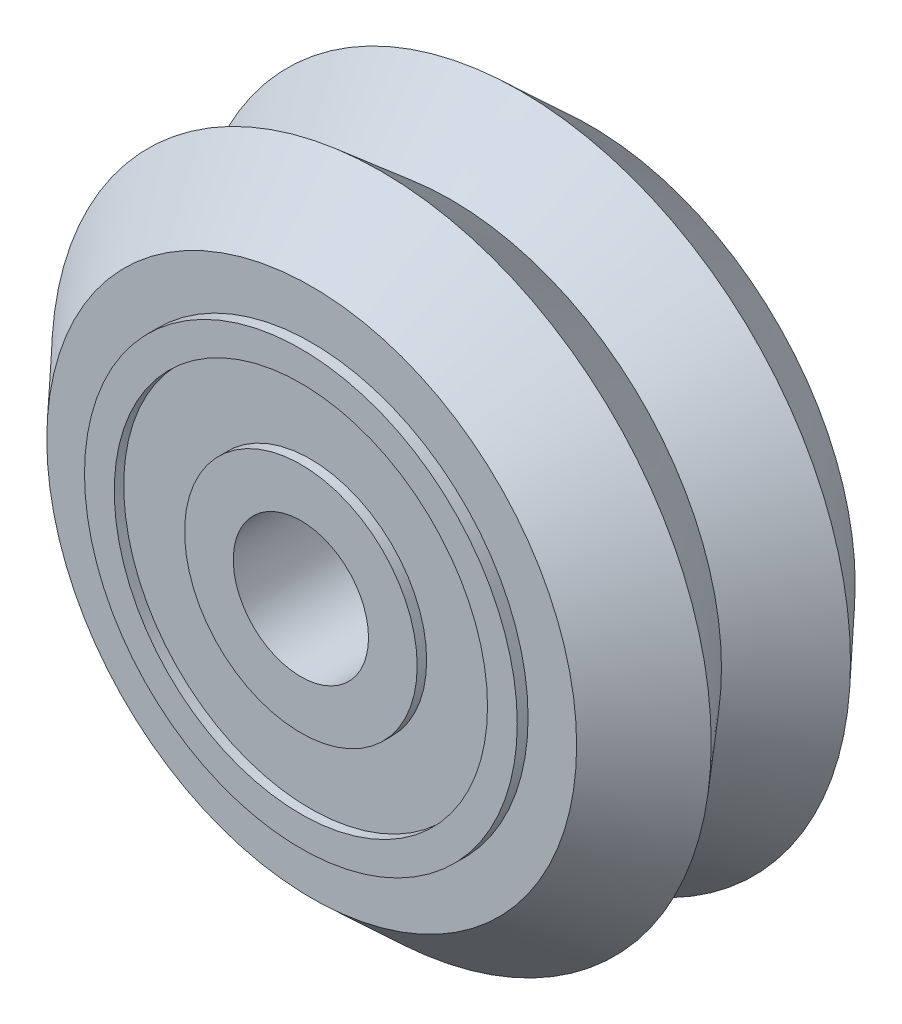
ISO-10303-21;
HEADER;
FILE_DESCRIPTION(('STEP AP214'),'2;1');
FILE_NAME('part.step','',(''),(''),'','','');
FILE_SCHEMA(('AUTOMOTIVE_DESIGN { 1 0 10303 214 1 1 1 1 }'));
ENDSEC;
DATA;
#1=APPLICATION_CONTEXT('core data for automotive mechanical design processes');
#2=APPLICATION_PROTOCOL_DEFINITION('international standard','automotive_design',2000,#1);
#3=PRODUCT_CONTEXT('',#1,'mechanical');
#4=PRODUCT('Part','Part','',(#3));
#5=PRODUCT_RELATED_PRODUCT_CATEGORY('part','',(#4));
#6=PRODUCT_DEFINITION_FORMATION('','',#4);
#7=PRODUCT_DEFINITION_CONTEXT('part definition',#1,'design');
#8=PRODUCT_DEFINITION('design','',#6,#7);
#9=PRODUCT_DEFINITION_SHAPE('','',#8);
#10=(LENGTH_UNIT() NAMED_UNIT(*) SI_UNIT(.MILLI.,.METRE.));
#11=(NAMED_UNIT(*) PLANE_ANGLE_UNIT() SI_UNIT($,.RADIAN.));
#12=(NAMED_UNIT(*) SI_UNIT($,.STERADIAN.) SOLID_ANGLE_UNIT());
#13=UNCERTAINTY_MEASURE_WITH_UNIT(LENGTH_MEASURE(1.E-05),#10,'distance_accuracy_value','');
#14=(GEOMETRIC_REPRESENTATION_CONTEXT(3) GLOBAL_UNCERTAINTY_ASSIGNED_CONTEXT((#13)) GLOBAL_UNIT_ASSIGNED_CONTEXT((#10,
#11,#12)) REPRESENTATION_CONTEXT('',''));
#15=CARTESIAN_POINT('',(0.,0.,0.));
#16=DIRECTION('',(0.,0.,1.));
#17=DIRECTION('',(1.,0.,0.));
#18=AXIS2_PLACEMENT_3D('',#15,#16,#17);
#19=CARTESIAN_POINT('',(-52.85022826763,28.7013200650294,32.7022724756846));
#20=DIRECTION('',(0.,0.,1.));
#21=DIRECTION('',(1.,0.,0.));
#22=AXIS2_PLACEMENT_3D('',#19,#20,#21);
#23=PLANE('',#22);
#24=CARTESIAN_POINT('',(-52.85022826763,20.7013200650294,32.7022724756846));
#25=DIRECTION('',(0.,0.,1.));
#26=DIRECTION('',(1.,0.,0.));
#27=AXIS2_PLACEMENT_3D('',#24,#25,#26);
#28=CIRCLE('',#27,8.);
#29=CARTESIAN_POINT('',(-44.85022826763,20.7013200650294,32.7022724756846));
#30=VERTEX_POINT('',#29);
#31=EDGE_CURVE('P0_E54',#30,#30,#28,.T.);
#32=ORIENTED_EDGE('',*,*,#31,.F.);
#33=EDGE_LOOP('',(#32));
#34=FACE_BOUND('',#33,.T.);
#35=CARTESIAN_POINT('',(-52.85022826763,20.7013200650294,32.7022724756846));
#36=DIRECTION('',(0.,0.,1.));
#37=DIRECTION('',(1.,0.,0.));
#38=AXIS2_PLACEMENT_3D('',#35,#36,#37);
#39=CIRCLE('',#38,6.9);
#40=CARTESIAN_POINT('',(-45.95022826763,20.7013200650294,32.7022724756846));
#41=VERTEX_POINT('',#40);
#42=EDGE_CURVE('P0_E9',#41,#41,#39,.T.);
#43=ORIENTED_EDGE('',*,*,#42,.T.);
#44=EDGE_LOOP('',(#43));
#45=FACE_BOUND('',#44,.T.);
#46=ADVANCED_FACE('P0_F14',(#34,#45),#23,.F.);
#47=CARTESIAN_POINT('',(-52.85022826763,20.7013200650294,47.2309463108101));
#48=DIRECTION('',(0.,0.,1.));
#49=DIRECTION('',(1.,0.,0.));
#50=AXIS2_PLACEMENT_3D('',#47,#48,#49);
#51=CYLINDRICAL_SURFACE('',#50,6.9);
#52=ORIENTED_EDGE('',*,*,#42,.F.);
#53=EDGE_LOOP('',(#52));
#54=FACE_BOUND('',#53,.T.);
#55=CARTESIAN_POINT('',(-52.85022826763,20.7013200650294,33.0522724756846));
#56=DIRECTION('',(0.,0.,1.));
#57=DIRECTION('',(1.,0.,0.));
#58=AXIS2_PLACEMENT_3D('',#55,#56,#57);
#59=CIRCLE('',#58,6.9);
#60=CARTESIAN_POINT('',(-45.95022826763,20.7013200650294,33.0522724756846));
#61=VERTEX_POINT('',#60);
#62=EDGE_CURVE('P0_E20',#61,#61,#59,.T.);
#63=ORIENTED_EDGE('',*,*,#62,.T.);
#64=EDGE_LOOP('',(#63));
#65=FACE_BOUND('',#64,.T.);
#66=ADVANCED_FACE('P0_F61',(#54,#65),#51,.F.);
#67=CARTESIAN_POINT('',(-52.85022826763,27.6013200650294,33.0522724756846));
#68=DIRECTION('',(0.,0.,1.));
#69=DIRECTION('',(1.,0.,0.));
#70=AXIS2_PLACEMENT_3D('',#67,#68,#69);
#71=PLANE('',#70);
#72=ORIENTED_EDGE('',*,*,#62,.F.);
#73=EDGE_LOOP('',(#72));
#74=FACE_BOUND('',#73,.T.);
#75=CARTESIAN_POINT('',(-52.85022826763,20.7013200650294,33.0522724756846));
#76=DIRECTION('',(0.,0.,1.));
#77=DIRECTION('',(1.,0.,0.));
#78=AXIS2_PLACEMENT_3D('',#75,#76,#77);
#79=CIRCLE('',#78,4.3);
#80=CARTESIAN_POINT('',(-48.55022826763,20.7013200650294,33.0522724756846));
#81=VERTEX_POINT('',#80);
#82=EDGE_CURVE('P0_E24',#81,#81,#79,.T.);
#83=ORIENTED_EDGE('',*,*,#82,.T.);
#84=EDGE_LOOP('',(#83));
#85=FACE_BOUND('',#84,.T.);
#86=ADVANCED_FACE('P0_F66',(#74,#85),#71,.F.);
#87=CARTESIAN_POINT('',(-52.85022826763,20.7013200650294,47.2309463108101));
#88=DIRECTION('',(0.,0.,1.));
#89=DIRECTION('',(1.,0.,0.));
#90=AXIS2_PLACEMENT_3D('',#87,#88,#89);
#91=CYLINDRICAL_SURFACE('',#90,4.3);
#92=ORIENTED_EDGE('',*,*,#82,.F.);
#93=EDGE_LOOP('',(#92));
#94=FACE_BOUND('',#93,.T.);
#95=CARTESIAN_POINT('',(-52.85022826763,20.7013200650294,32.7022724756846));
#96=DIRECTION('',(0.,0.,1.));
#97=DIRECTION('',(1.,0.,0.));
#98=AXIS2_PLACEMENT_3D('',#95,#96,#97);
#99=CIRCLE('',#98,4.3);
#100=CARTESIAN_POINT('',(-48.55022826763,20.7013200650294,32.7022724756846));
#101=VERTEX_POINT('',#100);
#102=EDGE_CURVE('P0_E28',#101,#101,#99,.T.);
#103=ORIENTED_EDGE('',*,*,#102,.T.);
#104=EDGE_LOOP('',(#103));
#105=FACE_BOUND('',#104,.T.);
#106=ADVANCED_FACE('P0_F71',(#94,#105),#91,.T.);
#107=CARTESIAN_POINT('',(-52.85022826763,25.0013200650294,32.7022724756846));
#108=DIRECTION('',(0.,0.,1.));
#109=DIRECTION('',(1.,0.,0.));
#110=AXIS2_PLACEMENT_3D('',#107,#108,#109);
#111=PLANE('',#110);
#112=ORIENTED_EDGE('',*,*,#102,.F.);
#113=EDGE_LOOP('',(#112));
#114=FACE_BOUND('',#113,.T.);
#115=CARTESIAN_POINT('',(-52.85022826763,20.7013200650294,32.7022724756846));
#116=DIRECTION('',(0.,0.,1.));
#117=DIRECTION('',(1.,0.,0.));
#118=AXIS2_PLACEMENT_3D('',#115,#116,#117);
#119=CIRCLE('',#118,2.5);
#120=CARTESIAN_POINT('',(-50.35022826763,20.7013200650294,32.7022724756846));
#121=VERTEX_POINT('',#120);
#122=EDGE_CURVE('P0_E33',#121,#121,#119,.T.);
#123=ORIENTED_EDGE('',*,*,#122,.T.);
#124=EDGE_LOOP('',(#123));
#125=FACE_BOUND('',#124,.T.);
#126=ADVANCED_FACE('P0_F77',(#114,#125),#111,.F.);
#127=CARTESIAN_POINT('',(-52.85022826763,20.7013200650294,47.2309463108101));
#128=DIRECTION('',(0.,0.,1.));
#129=DIRECTION('',(1.,0.,0.));
#130=AXIS2_PLACEMENT_3D('',#127,#128,#129);
#131=CYLINDRICAL_SURFACE('',#130,2.5);
#132=ORIENTED_EDGE('',*,*,#122,.F.);
#133=EDGE_LOOP('',(#132));
#134=FACE_BOUND('',#133,.T.);
#135=CARTESIAN_POINT('',(-52.85022826763,20.7013200650294,37.7022724756846));
#136=DIRECTION('',(0.,0.,1.));
#137=DIRECTION('',(1.,0.,0.));
#138=AXIS2_PLACEMENT_3D('',#135,#136,#137);
#139=CIRCLE('',#138,2.5);
#140=CARTESIAN_POINT('',(-50.35022826763,20.7013200650294,37.7022724756846));
#141=VERTEX_POINT('',#140);
#142=EDGE_CURVE('P0_E36',#141,#141,#139,.T.);
#143=ORIENTED_EDGE('',*,*,#142,.T.);
#144=EDGE_LOOP('',(#143));
#145=FACE_BOUND('',#144,.T.);
#146=ADVANCED_FACE('P0_F81',(#134,#145),#131,.F.);
#147=CARTESIAN_POINT('',(-52.85022826763,25.0013200650294,37.7022724756846));
#148=DIRECTION('',(0.,0.,-1.));
#149=DIRECTION('',(-1.,0.,0.));
#150=AXIS2_PLACEMENT_3D('',#147,#148,#149);
#151=PLANE('',#150);
#152=ORIENTED_EDGE('',*,*,#142,.F.);
#153=EDGE_LOOP('',(#152));
#154=FACE_BOUND('',#153,.T.);
#155=CARTESIAN_POINT('',(-52.85022826763,20.7013200650294,37.7022724756846));
#156=DIRECTION('',(0.,0.,1.));
#157=DIRECTION('',(1.,0.,0.));
#158=AXIS2_PLACEMENT_3D('',#155,#156,#157);
#159=CIRCLE('',#158,4.3);
#160=CARTESIAN_POINT('',(-48.55022826763,20.7013200650294,37.7022724756846));
#161=VERTEX_POINT('',#160);
#162=EDGE_CURVE('P0_E39',#161,#161,#159,.T.);
#163=ORIENTED_EDGE('',*,*,#162,.T.);
#164=EDGE_LOOP('',(#163));
#165=FACE_BOUND('',#164,.T.);
#166=ADVANCED_FACE('P0_F85',(#154,#165),#151,.F.);
#167=CARTESIAN_POINT('',(-52.85022826763,20.7013200650294,47.2309463108101));
#168=DIRECTION('',(0.,0.,1.));
#169=DIRECTION('',(1.,0.,0.));
#170=AXIS2_PLACEMENT_3D('',#167,#168,#169);
#171=CYLINDRICAL_SURFACE('',#170,4.3);
#172=ORIENTED_EDGE('',*,*,#162,.F.);
#173=EDGE_LOOP('',(#172));
#174=FACE_BOUND('',#173,.T.);
#175=CARTESIAN_POINT('',(-52.85022826763,20.7013200650294,37.3522724756846));
#176=DIRECTION('',(0.,0.,1.));
#177=DIRECTION('',(1.,0.,0.));
#178=AXIS2_PLACEMENT_3D('',#175,#176,#177);
#179=CIRCLE('',#178,4.3);
#180=CARTESIAN_POINT('',(-48.55022826763,20.7013200650294,37.3522724756846));
#181=VERTEX_POINT('',#180);
#182=EDGE_CURVE('P0_E42',#181,#181,#179,.T.);
#183=ORIENTED_EDGE('',*,*,#182,.T.);
#184=EDGE_LOOP('',(#183));
#185=FACE_BOUND('',#184,.T.);
#186=ADVANCED_FACE('P0_F89',(#174,#185),#171,.T.);
#187=CARTESIAN_POINT('',(-52.85022826763,27.6013200650294,37.3522724756846));
#188=DIRECTION('',(0.,0.,-1.));
#189=DIRECTION('',(-1.,0.,0.));
#190=AXIS2_PLACEMENT_3D('',#187,#188,#189);
#191=PLANE('',#190);
#192=ORIENTED_EDGE('',*,*,#182,.F.);
#193=EDGE_LOOP('',(#192));
#194=FACE_BOUND('',#193,.T.);
#195=CARTESIAN_POINT('',(-52.85022826763,20.7013200650294,37.3522724756846));
#196=DIRECTION('',(0.,0.,1.));
#197=DIRECTION('',(1.,0.,0.));
#198=AXIS2_PLACEMENT_3D('',#195,#196,#197);
#199=CIRCLE('',#198,6.9);
#200=CARTESIAN_POINT('',(-45.95022826763,20.7013200650294,37.3522724756846));
#201=VERTEX_POINT('',#200);
#202=EDGE_CURVE('P0_E45',#201,#201,#199,.T.);
#203=ORIENTED_EDGE('',*,*,#202,.T.);
#204=EDGE_LOOP('',(#203));
#205=FACE_BOUND('',#204,.T.);
#206=ADVANCED_FACE('P0_F93',(#194,#205),#191,.F.);
#207=CARTESIAN_POINT('',(-52.85022826763,20.7013200650294,47.2309463108101));
#208=DIRECTION('',(0.,0.,1.));
#209=DIRECTION('',(1.,0.,0.));
#210=AXIS2_PLACEMENT_3D('',#207,#208,#209);
#211=CYLINDRICAL_SURFACE('',#210,6.9);
#212=ORIENTED_EDGE('',*,*,#202,.F.);
#213=EDGE_LOOP('',(#212));
#214=FACE_BOUND('',#213,.T.);
#215=CARTESIAN_POINT('',(-52.85022826763,20.7013200650294,37.7022724756846));
#216=DIRECTION('',(0.,0.,1.));
#217=DIRECTION('',(1.,0.,0.));
#218=AXIS2_PLACEMENT_3D('',#215,#216,#217);
#219=CIRCLE('',#218,6.9);
#220=CARTESIAN_POINT('',(-45.95022826763,20.7013200650294,37.7022724756846));
#221=VERTEX_POINT('',#220);
#222=EDGE_CURVE('P0_E48',#221,#221,#219,.T.);
#223=ORIENTED_EDGE('',*,*,#222,.T.);
#224=EDGE_LOOP('',(#223));
#225=FACE_BOUND('',#224,.T.);
#226=ADVANCED_FACE('P0_F97',(#214,#225),#211,.F.);
#227=CARTESIAN_POINT('',(-52.85022826763,28.7013200650294,37.7022724756846));
#228=DIRECTION('',(0.,0.,-1.));
#229=DIRECTION('',(-1.,0.,0.));
#230=AXIS2_PLACEMENT_3D('',#227,#228,#229);
#231=PLANE('',#230);
#232=ORIENTED_EDGE('',*,*,#222,.F.);
#233=EDGE_LOOP('',(#232));
#234=FACE_BOUND('',#233,.T.);
#235=CARTESIAN_POINT('',(-52.85022826763,20.7013200650294,37.7022724756846));
#236=DIRECTION('',(0.,0.,1.));
#237=DIRECTION('',(1.,0.,0.));
#238=AXIS2_PLACEMENT_3D('',#235,#236,#237);
#239=CIRCLE('',#238,8.);
#240=CARTESIAN_POINT('',(-44.85022826763,20.7013200650294,37.7022724756846));
#241=VERTEX_POINT('',#240);
#242=EDGE_CURVE('P0_E51',#241,#241,#239,.T.);
#243=ORIENTED_EDGE('',*,*,#242,.T.);
#244=EDGE_LOOP('',(#243));
#245=FACE_BOUND('',#244,.T.);
#246=ADVANCED_FACE('P0_F101',(#234,#245),#231,.F.);
#247=CARTESIAN_POINT('',(-52.85022826763,20.7013200650294,47.2309463108101));
#248=DIRECTION('',(0.,0.,1.));
#249=DIRECTION('',(1.,0.,0.));
#250=AXIS2_PLACEMENT_3D('',#247,#248,#249);
#251=CYLINDRICAL_SURFACE('',#250,8.);
#252=ORIENTED_EDGE('',*,*,#242,.F.);
#253=EDGE_LOOP('',(#252));
#254=FACE_BOUND('',#253,.T.);
#255=ORIENTED_EDGE('',*,*,#31,.T.);
#256=EDGE_LOOP('',(#255));
#257=FACE_BOUND('',#256,.T.);
#258=ADVANCED_FACE('P0_F58',(#254,#257),#251,.T.);
#259=CLOSED_SHELL('',(#46,#66,#86,#106,#126,#146,#166,#186,#206,#226,#246,#258));
#260=MANIFOLD_SOLID_BREP('P0_B1',#259);
#261=CARTESIAN_POINT('',(-52.85022826763,28.7013200650294,26.6022724756846));
#262=DIRECTION('',(0.,0.,1.));
#263=DIRECTION('',(1.,0.,0.));
#264=AXIS2_PLACEMENT_3D('',#261,#262,#263);
#265=PLANE('',#264);
#266=CARTESIAN_POINT('',(-52.85022826763,20.7013200650294,26.6022724756846));
#267=DIRECTION('',(0.,0.,1.));
#268=DIRECTION('',(1.,0.,0.));
#269=AXIS2_PLACEMENT_3D('',#266,#267,#268);
#270=CIRCLE('',#269,8.);
#271=CARTESIAN_POINT('',(-44.85022826763,20.7013200650294,26.6022724756846));
#272=VERTEX_POINT('',#271);
#273=EDGE_CURVE('P1_E55',#272,#272,#270,.T.);
#274=ORIENTED_EDGE('',*,*,#273,.F.);
#275=EDGE_LOOP('',(#274));
#276=FACE_BOUND('',#275,.T.);
#277=CARTESIAN_POINT('',(-52.85022826763,20.7013200650294,26.6022724756846));
#278=DIRECTION('',(0.,0.,1.));
#279=DIRECTION('',(1.,0.,0.));
#280=AXIS2_PLACEMENT_3D('',#277,#278,#279);
#281=CIRCLE('',#280,6.9);
#282=CARTESIAN_POINT('',(-45.95022826763,20.7013200650294,26.6022724756846));
#283=VERTEX_POINT('',#282);
#284=EDGE_CURVE('P1_E10',#283,#283,#281,.T.);
#285=ORIENTED_EDGE('',*,*,#284,.T.);
#286=EDGE_LOOP('',(#285));
#287=FACE_BOUND('',#286,.T.);
#288=ADVANCED_FACE('P1_F15',(#276,#287),#265,.F.);
#289=CARTESIAN_POINT('',(-52.85022826763,20.7013200650294,41.1309463108101));
#290=DIRECTION('',(0.,0.,1.));
#291=DIRECTION('',(1.,0.,0.));
#292=AXIS2_PLACEMENT_3D('',#289,#290,#291);
#293=CYLINDRICAL_SURFACE('',#292,6.9);
#294=ORIENTED_EDGE('',*,*,#284,.F.);
#295=EDGE_LOOP('',(#294));
#296=FACE_BOUND('',#295,.T.);
#297=CARTESIAN_POINT('',(-52.85022826763,20.7013200650294,26.9522724756846));
#298=DIRECTION('',(0.,0.,1.));
#299=DIRECTION('',(1.,0.,0.));
#300=AXIS2_PLACEMENT_3D('',#297,#298,#299);
#301=CIRCLE('',#300,6.9);
#302=CARTESIAN_POINT('',(-45.95022826763,20.7013200650294,26.9522724756846));
#303=VERTEX_POINT('',#302);
#304=EDGE_CURVE('P1_E21',#303,#303,#301,.T.);
#305=ORIENTED_EDGE('',*,*,#304,.T.);
#306=EDGE_LOOP('',(#305));
#307=FACE_BOUND('',#306,.T.);
#308=ADVANCED_FACE('P1_F62',(#296,#307),#293,.F.);
#309=CARTESIAN_POINT('',(-52.85022826763,27.6013200650294,26.9522724756846));
#310=DIRECTION('',(0.,0.,1.));
#311=DIRECTION('',(1.,0.,0.));
#312=AXIS2_PLACEMENT_3D('',#309,#310,#311);
#313=PLANE('',#312);
#314=ORIENTED_EDGE('',*,*,#304,.F.);
#315=EDGE_LOOP('',(#314));
#316=FACE_BOUND('',#315,.T.);
#317=CARTESIAN_POINT('',(-52.85022826763,20.7013200650294,26.9522724756846));
#318=DIRECTION('',(0.,0.,1.));
#319=DIRECTION('',(1.,0.,0.));
#320=AXIS2_PLACEMENT_3D('',#317,#318,#319);
#321=CIRCLE('',#320,4.3);
#322=CARTESIAN_POINT('',(-48.55022826763,20.7013200650294,26.9522724756846));
#323=VERTEX_POINT('',#322);
#324=EDGE_CURVE('P1_E25',#323,#323,#321,.T.);
#325=ORIENTED_EDGE('',*,*,#324,.T.);
#326=EDGE_LOOP('',(#325));
#327=FACE_BOUND('',#326,.T.);
#328=ADVANCED_FACE('P1_F67',(#316,#327),#313,.F.);
#329=CARTESIAN_POINT('',(-52.85022826763,20.7013200650294,41.1309463108101));
#330=DIRECTION('',(0.,0.,1.));
#331=DIRECTION('',(1.,0.,0.));
#332=AXIS2_PLACEMENT_3D('',#329,#330,#331);
#333=CYLINDRICAL_SURFACE('',#332,4.3);
#334=ORIENTED_EDGE('',*,*,#324,.F.);
#335=EDGE_LOOP('',(#334));
#336=FACE_BOUND('',#335,.T.);
#337=CARTESIAN_POINT('',(-52.85022826763,20.7013200650294,26.6022724756846));
#338=DIRECTION('',(0.,0.,1.));
#339=DIRECTION('',(1.,0.,0.));
#340=AXIS2_PLACEMENT_3D('',#337,#338,#339);
#341=CIRCLE('',#340,4.3);
#342=CARTESIAN_POINT('',(-48.55022826763,20.7013200650294,26.6022724756846));
#343=VERTEX_POINT('',#342);
#344=EDGE_CURVE('P1_E29',#343,#343,#341,.T.);
#345=ORIENTED_EDGE('',*,*,#344,.T.);
#346=EDGE_LOOP('',(#345));
#347=FACE_BOUND('',#346,.T.);
#348=ADVANCED_FACE('P1_F72',(#336,#347),#333,.T.);
#349=CARTESIAN_POINT('',(-52.85022826763,25.0013200650294,26.6022724756846));
#350=DIRECTION('',(0.,0.,1.));
#351=DIRECTION('',(1.,0.,0.));
#352=AXIS2_PLACEMENT_3D('',#349,#350,#351);
#353=PLANE('',#352);
#354=ORIENTED_EDGE('',*,*,#344,.F.);
#355=EDGE_LOOP('',(#354));
#356=FACE_BOUND('',#355,.T.);
#357=CARTESIAN_POINT('',(-52.85022826763,20.7013200650294,26.6022724756846));
#358=DIRECTION('',(0.,0.,1.));
#359=DIRECTION('',(1.,0.,0.));
#360=AXIS2_PLACEMENT_3D('',#357,#358,#359);
#361=CIRCLE('',#360,2.5);
#362=CARTESIAN_POINT('',(-50.35022826763,20.7013200650294,26.6022724756846));
#363=VERTEX_POINT('',#362);
#364=EDGE_CURVE('P1_E34',#363,#363,#361,.T.);
#365=ORIENTED_EDGE('',*,*,#364,.T.);
#366=EDGE_LOOP('',(#365));
#367=FACE_BOUND('',#366,.T.);
#368=ADVANCED_FACE('P1_F78',(#356,#367),#353,.F.);
#369=CARTESIAN_POINT('',(-52.85022826763,20.7013200650294,41.1309463108101));
#370=DIRECTION('',(0.,0.,1.));
#371=DIRECTION('',(1.,0.,0.));
#372=AXIS2_PLACEMENT_3D('',#369,#370,#371);
#373=CYLINDRICAL_SURFACE('',#372,2.5);
#374=ORIENTED_EDGE('',*,*,#364,.F.);
#375=EDGE_LOOP('',(#374));
#376=FACE_BOUND('',#375,.T.);
#377=CARTESIAN_POINT('',(-52.85022826763,20.7013200650294,31.6022724756846));
#378=DIRECTION('',(0.,0.,1.));
#379=DIRECTION('',(1.,0.,0.));
#380=AXIS2_PLACEMENT_3D('',#377,#378,#379);
#381=CIRCLE('',#380,2.5);
#382=CARTESIAN_POINT('',(-50.35022826763,20.7013200650294,31.6022724756846));
#383=VERTEX_POINT('',#382);
#384=EDGE_CURVE('P1_E37',#383,#383,#381,.T.);
#385=ORIENTED_EDGE('',*,*,#384,.T.);
#386=EDGE_LOOP('',(#385));
#387=FACE_BOUND('',#386,.T.);
#388=ADVANCED_FACE('P1_F82',(#376,#387),#373,.F.);
#389=CARTESIAN_POINT('',(-52.85022826763,25.0013200650294,31.6022724756846));
#390=DIRECTION('',(0.,0.,-1.));
#391=DIRECTION('',(-1.,0.,0.));
#392=AXIS2_PLACEMENT_3D('',#389,#390,#391);
#393=PLANE('',#392);
#394=ORIENTED_EDGE('',*,*,#384,.F.);
#395=EDGE_LOOP('',(#394));
#396=FACE_BOUND('',#395,.T.);
#397=CARTESIAN_POINT('',(-52.85022826763,20.7013200650294,31.6022724756846));
#398=DIRECTION('',(0.,0.,1.));
#399=DIRECTION('',(1.,0.,0.));
#400=AXIS2_PLACEMENT_3D('',#397,#398,#399);
#401=CIRCLE('',#400,4.3);
#402=CARTESIAN_POINT('',(-48.55022826763,20.7013200650294,31.6022724756846));
#403=VERTEX_POINT('',#402);
#404=EDGE_CURVE('P1_E40',#403,#403,#401,.T.);
#405=ORIENTED_EDGE('',*,*,#404,.T.);
#406=EDGE_LOOP('',(#405));
#407=FACE_BOUND('',#406,.T.);
#408=ADVANCED_FACE('P1_F86',(#396,#407),#393,.F.);
#409=CARTESIAN_POINT('',(-52.85022826763,20.7013200650294,41.1309463108101));
#410=DIRECTION('',(0.,0.,1.));
#411=DIRECTION('',(1.,0.,0.));
#412=AXIS2_PLACEMENT_3D('',#409,#410,#411);
#413=CYLINDRICAL_SURFACE('',#412,4.3);
#414=ORIENTED_EDGE('',*,*,#404,.F.);
#415=EDGE_LOOP('',(#414));
#416=FACE_BOUND('',#415,.T.);
#417=CARTESIAN_POINT('',(-52.85022826763,20.7013200650294,31.2522724756846));
#418=DIRECTION('',(0.,0.,1.));
#419=DIRECTION('',(1.,0.,0.));
#420=AXIS2_PLACEMENT_3D('',#417,#418,#419);
#421=CIRCLE('',#420,4.3);
#422=CARTESIAN_POINT('',(-48.55022826763,20.7013200650294,31.2522724756846));
#423=VERTEX_POINT('',#422);
#424=EDGE_CURVE('P1_E43',#423,#423,#421,.T.);
#425=ORIENTED_EDGE('',*,*,#424,.T.);
#426=EDGE_LOOP('',(#425));
#427=FACE_BOUND('',#426,.T.);
#428=ADVANCED_FACE('P1_F90',(#416,#427),#413,.T.);
#429=CARTESIAN_POINT('',(-52.85022826763,27.6013200650294,31.2522724756846));
#430=DIRECTION('',(0.,0.,-1.));
#431=DIRECTION('',(-1.,0.,0.));
#432=AXIS2_PLACEMENT_3D('',#429,#430,#431);
#433=PLANE('',#432);
#434=ORIENTED_EDGE('',*,*,#424,.F.);
#435=EDGE_LOOP('',(#434));
#436=FACE_BOUND('',#435,.T.);
#437=CARTESIAN_POINT('',(-52.85022826763,20.7013200650294,31.2522724756846));
#438=DIRECTION('',(0.,0.,1.));
#439=DIRECTION('',(1.,0.,0.));
#440=AXIS2_PLACEMENT_3D('',#437,#438,#439);
#441=CIRCLE('',#440,6.9);
#442=CARTESIAN_POINT('',(-45.95022826763,20.7013200650294,31.2522724756846));
#443=VERTEX_POINT('',#442);
#444=EDGE_CURVE('P1_E46',#443,#443,#441,.T.);
#445=ORIENTED_EDGE('',*,*,#444,.T.);
#446=EDGE_LOOP('',(#445));
#447=FACE_BOUND('',#446,.T.);
#448=ADVANCED_FACE('P1_F94',(#436,#447),#433,.F.);
#449=CARTESIAN_POINT('',(-52.85022826763,20.7013200650294,41.1309463108101));
#450=DIRECTION('',(0.,0.,1.));
#451=DIRECTION('',(1.,0.,0.));
#452=AXIS2_PLACEMENT_3D('',#449,#450,#451);
#453=CYLINDRICAL_SURFACE('',#452,6.9);
#454=ORIENTED_EDGE('',*,*,#444,.F.);
#455=EDGE_LOOP('',(#454));
#456=FACE_BOUND('',#455,.T.);
#457=CARTESIAN_POINT('',(-52.85022826763,20.7013200650294,31.6022724756846));
#458=DIRECTION('',(0.,0.,1.));
#459=DIRECTION('',(1.,0.,0.));
#460=AXIS2_PLACEMENT_3D('',#457,#458,#459);
#461=CIRCLE('',#460,6.9);
#462=CARTESIAN_POINT('',(-45.95022826763,20.7013200650294,31.6022724756846));
#463=VERTEX_POINT('',#462);
#464=EDGE_CURVE('P1_E49',#463,#463,#461,.T.);
#465=ORIENTED_EDGE('',*,*,#464,.T.);
#466=EDGE_LOOP('',(#465));
#467=FACE_BOUND('',#466,.T.);
#468=ADVANCED_FACE('P1_F98',(#456,#467),#453,.F.);
#469=CARTESIAN_POINT('',(-52.85022826763,28.7013200650294,31.6022724756846));
#470=DIRECTION('',(0.,0.,-1.));
#471=DIRECTION('',(-1.,0.,0.));
#472=AXIS2_PLACEMENT_3D('',#469,#470,#471);
#473=PLANE('',#472);
#474=ORIENTED_EDGE('',*,*,#464,.F.);
#475=EDGE_LOOP('',(#474));
#476=FACE_BOUND('',#475,.T.);
#477=CARTESIAN_POINT('',(-52.85022826763,20.7013200650294,31.6022724756846));
#478=DIRECTION('',(0.,0.,1.));
#479=DIRECTION('',(1.,0.,0.));
#480=AXIS2_PLACEMENT_3D('',#477,#478,#479);
#481=CIRCLE('',#480,8.);
#482=CARTESIAN_POINT('',(-44.85022826763,20.7013200650294,31.6022724756846));
#483=VERTEX_POINT('',#482);
#484=EDGE_CURVE('P1_E52',#483,#483,#481,.T.);
#485=ORIENTED_EDGE('',*,*,#484,.T.);
#486=EDGE_LOOP('',(#485));
#487=FACE_BOUND('',#486,.T.);
#488=ADVANCED_FACE('P1_F102',(#476,#487),#473,.F.);
#489=CARTESIAN_POINT('',(-52.85022826763,20.7013200650294,41.1309463108101));
#490=DIRECTION('',(0.,0.,1.));
#491=DIRECTION('',(1.,0.,0.));
#492=AXIS2_PLACEMENT_3D('',#489,#490,#491);
#493=CYLINDRICAL_SURFACE('',#492,8.);
#494=ORIENTED_EDGE('',*,*,#484,.F.);
#495=EDGE_LOOP('',(#494));
#496=FACE_BOUND('',#495,.T.);
#497=ORIENTED_EDGE('',*,*,#273,.T.);
#498=EDGE_LOOP('',(#497));
#499=FACE_BOUND('',#498,.T.);
#500=ADVANCED_FACE('P1_F59',(#496,#499),#493,.T.);
#501=CLOSED_SHELL('',(#288,#308,#328,#348,#368,#388,#408,#428,#448,#468,#488,#500));
#502=MANIFOLD_SOLID_BREP('P1_B1',#501);
#503=CARTESIAN_POINT('',(-52.85022826763,20.7013200650294,31.6522724756846));
#504=DIRECTION('',(0.,0.,1.));
#505=DIRECTION('',(-1.,0.,0.));
#506=AXIS2_PLACEMENT_3D('',#503,#504,#505);
#507=CYLINDRICAL_SURFACE('',#506,2.6);
#508=CARTESIAN_POINT('',(-52.85022826763,20.7013200650294,31.6522724756846));
#509=DIRECTION('',(0.,0.,1.));
#510=DIRECTION('',(-1.,0.,0.));
#511=AXIS2_PLACEMENT_3D('',#508,#509,#510);
#512=CIRCLE('',#511,2.6);
#513=CARTESIAN_POINT('',(-50.25022826763,20.7013200650294,31.6522724756846));
#514=VERTEX_POINT('',#513);
#515=EDGE_CURVE('P2_E39',#514,#514,#512,.T.);
#516=ORIENTED_EDGE('',*,*,#515,.F.);
#517=DIRECTION('',(0.,0.,1.));
#518=VECTOR('',#517,1.);
#519=CARTESIAN_POINT('',(-50.25022826763,20.7013200650294,31.6522724756846));
#520=LINE('',#519,#518);
#521=CARTESIAN_POINT('',(-50.25022826763,20.7013200650294,32.6522724756846));
#522=VERTEX_POINT('',#521);
#523=EDGE_CURVE('P2_E11',#514,#522,#520,.T.);
#524=ORIENTED_EDGE('',*,*,#523,.T.);
#525=CARTESIAN_POINT('',(-52.85022826763,20.7013200650294,32.6522724756846));
#526=DIRECTION('',(0.,0.,-1.));
#527=DIRECTION('',(-1.,0.,0.));
#528=AXIS2_PLACEMENT_3D('',#525,#526,#527);
#529=CIRCLE('',#528,2.6);
#530=EDGE_CURVE('P2_E69',#522,#522,#529,.T.);
#531=ORIENTED_EDGE('',*,*,#530,.F.);
#532=ORIENTED_EDGE('',*,*,#523,.F.);
#533=EDGE_LOOP('',(#516,#524,#531,#532));
#534=FACE_BOUND('',#533,.T.);
#535=ADVANCED_FACE('P2_F17',(#534),#507,.F.);
#536=CARTESIAN_POINT('',(-52.85022826763,20.7013200650294,31.6522724756846));
#537=DIRECTION('',(0.,0.,1.));
#538=DIRECTION('',(-1.,0.,0.));
#539=AXIS2_PLACEMENT_3D('',#536,#537,#538);
#540=CYLINDRICAL_SURFACE('',#539,5.);
#541=CARTESIAN_POINT('',(-52.85022826763,20.7013200650294,32.6522724756846));
#542=DIRECTION('',(0.,0.,1.));
#543=DIRECTION('',(-1.,0.,0.));
#544=AXIS2_PLACEMENT_3D('',#541,#542,#543);
#545=CIRCLE('',#544,5.);
#546=CARTESIAN_POINT('',(-47.85022826763,20.7013200650294,32.6522724756846));
#547=VERTEX_POINT('',#546);
#548=EDGE_CURVE('P2_E52',#547,#547,#545,.T.);
#549=ORIENTED_EDGE('',*,*,#548,.F.);
#550=DIRECTION('',(0.,0.,-1.));
#551=VECTOR('',#550,1.);
#552=CARTESIAN_POINT('',(-47.85022826763,20.7013200650294,31.6522724756846));
#553=LINE('',#552,#551);
#554=CARTESIAN_POINT('',(-47.85022826763,20.7013200650294,31.6522724756846));
#555=VERTEX_POINT('',#554);
#556=EDGE_CURVE('P2_E21',#547,#555,#553,.T.);
#557=ORIENTED_EDGE('',*,*,#556,.T.);
#558=CARTESIAN_POINT('',(-52.85022826763,20.7013200650294,31.6522724756846));
#559=DIRECTION('',(0.,0.,-1.));
#560=DIRECTION('',(-1.,0.,0.));
#561=AXIS2_PLACEMENT_3D('',#558,#559,#560);
#562=CIRCLE('',#561,5.);
#563=EDGE_CURVE('P2_E57',#555,#555,#562,.T.);
#564=ORIENTED_EDGE('',*,*,#563,.F.);
#565=ORIENTED_EDGE('',*,*,#556,.F.);
#566=EDGE_LOOP('',(#549,#557,#564,#565));
#567=FACE_BOUND('',#566,.T.);
#568=ADVANCED_FACE('P2_F58',(#567),#540,.T.);
#569=CARTESIAN_POINT('',(-52.85022826763,20.7013200650294,31.6522724756846));
#570=DIRECTION('',(0.,0.,1.));
#571=DIRECTION('',(1.,0.,0.));
#572=AXIS2_PLACEMENT_3D('',#569,#570,#571);
#573=PLANE('',#572);
#574=ORIENTED_EDGE('',*,*,#563,.T.);
#575=EDGE_LOOP('',(#574));
#576=FACE_BOUND('',#575,.T.);
#577=ORIENTED_EDGE('',*,*,#515,.T.);
#578=EDGE_LOOP('',(#577));
#579=FACE_BOUND('',#578,.T.);
#580=ADVANCED_FACE('P2_F80',(#576,#579),#573,.F.);
#581=CARTESIAN_POINT('',(-52.85022826763,20.7013200650294,32.6522724756846));
#582=DIRECTION('',(0.,0.,1.));
#583=DIRECTION('',(1.,0.,0.));
#584=AXIS2_PLACEMENT_3D('',#581,#582,#583);
#585=PLANE('',#584);
#586=ORIENTED_EDGE('',*,*,#548,.T.);
#587=EDGE_LOOP('',(#586));
#588=FACE_BOUND('',#587,.T.);
#589=ORIENTED_EDGE('',*,*,#530,.T.);
#590=EDGE_LOOP('',(#589));
#591=FACE_BOUND('',#590,.T.);
#592=ADVANCED_FACE('P2_F19',(#588,#591),#585,.T.);
#593=CLOSED_SHELL('',(#535,#568,#580,#592));
#594=MANIFOLD_SOLID_BREP('P2_B1',#593);
#595=CARTESIAN_POINT('',(-44.85522826763,20.7013200650294,31.6022724756846));
#596=DIRECTION('',(0.,0.,-1.));
#597=DIRECTION('',(1.,0.,0.));
#598=AXIS2_PLACEMENT_3D('',#595,#596,#597);
#599=PLANE('',#598);
#600=CARTESIAN_POINT('',(-52.85022826763,20.7013200650294,31.6022724756846));
#601=DIRECTION('',(0.,0.,1.));
#602=DIRECTION('',(1.,0.,0.));
#603=AXIS2_PLACEMENT_3D('',#600,#601,#602);
#604=CIRCLE('',#603,7.995);
#605=CARTESIAN_POINT('',(-44.85522826763,20.7013200650294,31.6022724756846));
#606=VERTEX_POINT('',#605);
#607=CARTESIAN_POINT('',(-60.84522826763,20.7013200650294,31.6022724756846));
#608=VERTEX_POINT('',#607);
#609=EDGE_CURVE('P3_E40',#606,#608,#604,.T.);
#610=ORIENTED_EDGE('',*,*,#609,.F.);
#611=CARTESIAN_POINT('',(-52.85022826763,20.7013200650294,31.6022724756846));
#612=DIRECTION('',(0.,0.,1.));
#613=DIRECTION('',(1.,0.,0.));
#614=AXIS2_PLACEMENT_3D('',#611,#612,#613);
#615=CIRCLE('',#614,7.995);
#616=EDGE_CURVE('P3_E154',#608,#606,#615,.T.);
#617=ORIENTED_EDGE('',*,*,#616,.F.);
#618=EDGE_LOOP('',(#610,#617));
#619=FACE_BOUND('',#618,.T.);
#620=CARTESIAN_POINT('',(-52.85022826763,20.7013200650294,31.6022724756846));
#621=DIRECTION('',(0.,0.,1.));
#622=DIRECTION('',(1.,0.,0.));
#623=AXIS2_PLACEMENT_3D('',#620,#621,#622);
#624=CIRCLE('',#623,6.995);
#625=CARTESIAN_POINT('',(-45.85522826763,20.7013200650294,31.6022724756846));
#626=VERTEX_POINT('',#625);
#627=CARTESIAN_POINT('',(-59.84522826763,20.7013200650294,31.6022724756846));
#628=VERTEX_POINT('',#627);
#629=EDGE_CURVE('P3_E11',#626,#628,#624,.T.);
#630=ORIENTED_EDGE('',*,*,#629,.T.);
#631=CARTESIAN_POINT('',(-52.85022826763,20.7013200650294,31.6022724756846));
#632=DIRECTION('',(0.,0.,1.));
#633=DIRECTION('',(1.,0.,0.));
#634=AXIS2_PLACEMENT_3D('',#631,#632,#633);
#635=CIRCLE('',#634,6.995);
#636=EDGE_CURVE('P3_E28',#628,#626,#635,.T.);
#637=ORIENTED_EDGE('',*,*,#636,.T.);
#638=EDGE_LOOP('',(#630,#637));
#639=FACE_BOUND('',#638,.T.);
#640=ADVANCED_FACE('P3_F17',(#619,#639),#599,.T.);
#641=CARTESIAN_POINT('',(-52.85022826763,20.7013200650294,29.3022724756846));
#642=DIRECTION('',(0.,0.,1.));
#643=DIRECTION('',(1.,0.,0.));
#644=AXIS2_PLACEMENT_3D('',#641,#642,#643);
#645=CYLINDRICAL_SURFACE('',#644,7.995);
#646=ORIENTED_EDGE('',*,*,#609,.T.);
#647=DIRECTION('',(0.,0.,-1.));
#648=VECTOR('',#647,1.);
#649=CARTESIAN_POINT('',(-60.84522826763,20.7013200650294,29.3022724756846));
#650=LINE('',#649,#648);
#651=CARTESIAN_POINT('',(-60.84522826763,20.7013200650294,27.0022724756846));
#652=VERTEX_POINT('',#651);
#653=EDGE_CURVE('P3_E150',#608,#652,#650,.T.);
#654=ORIENTED_EDGE('',*,*,#653,.T.);
#655=CARTESIAN_POINT('',(-52.85022826763,20.7013200650294,27.0022724756846));
#656=DIRECTION('',(0.,0.,1.));
#657=DIRECTION('',(1.,0.,0.));
#658=AXIS2_PLACEMENT_3D('',#655,#656,#657);
#659=CIRCLE('',#658,7.995);
#660=CARTESIAN_POINT('',(-44.85522826763,20.7013200650294,27.0022724756846));
#661=VERTEX_POINT('',#660);
#662=EDGE_CURVE('P3_E155',#661,#652,#659,.T.);
#663=ORIENTED_EDGE('',*,*,#662,.F.);
#664=CARTESIAN_POINT('',(-52.85022826763,20.7013200650294,27.0022724756846));
#665=DIRECTION('',(0.,0.,1.));
#666=DIRECTION('',(1.,0.,0.));
#667=AXIS2_PLACEMENT_3D('',#664,#665,#666);
#668=CIRCLE('',#667,7.995);
#669=EDGE_CURVE('P3_E158',#652,#661,#668,.T.);
#670=ORIENTED_EDGE('',*,*,#669,.F.);
#671=ORIENTED_EDGE('',*,*,#653,.F.);
#672=ORIENTED_EDGE('',*,*,#616,.T.);
#673=EDGE_LOOP('',(#646,#654,#663,#670,#671,#672));
#674=FACE_BOUND('',#673,.T.);
#675=ADVANCED_FACE('P3_F164',(#674),#645,.F.);
#676=CARTESIAN_POINT('',(-43.05522826763,20.7013200650294,27.0022724756846));
#677=DIRECTION('',(0.,0.,-1.));
#678=DIRECTION('',(1.,0.,0.));
#679=AXIS2_PLACEMENT_3D('',#676,#677,#678);
#680=PLANE('',#679);
#681=CARTESIAN_POINT('',(-52.85022826763,20.7013200650294,27.0022724756846));
#682=DIRECTION('',(0.,0.,1.));
#683=DIRECTION('',(1.,0.,0.));
#684=AXIS2_PLACEMENT_3D('',#681,#682,#683);
#685=CIRCLE('',#684,9.795);
#686=CARTESIAN_POINT('',(-43.05522826763,20.7013200650294,27.0022724756846));
#687=VERTEX_POINT('',#686);
#688=CARTESIAN_POINT('',(-62.64522826763,20.7013200650294,27.0022724756846));
#689=VERTEX_POINT('',#688);
#690=EDGE_CURVE('P3_E206',#687,#689,#685,.T.);
#691=ORIENTED_EDGE('',*,*,#690,.F.);
#692=CARTESIAN_POINT('',(-52.85022826763,20.7013200650294,27.0022724756846));
#693=DIRECTION('',(0.,0.,1.));
#694=DIRECTION('',(1.,0.,0.));
#695=AXIS2_PLACEMENT_3D('',#692,#693,#694);
#696=CIRCLE('',#695,9.795);
#697=EDGE_CURVE('P3_E21',#689,#687,#696,.T.);
#698=ORIENTED_EDGE('',*,*,#697,.F.);
#699=EDGE_LOOP('',(#691,#698));
#700=FACE_BOUND('',#699,.T.);
#701=ORIENTED_EDGE('',*,*,#662,.T.);
#702=ORIENTED_EDGE('',*,*,#669,.T.);
#703=EDGE_LOOP('',(#701,#702));
#704=FACE_BOUND('',#703,.T.);
#705=ADVANCED_FACE('P3_F276',(#700,#704),#680,.T.);
#706=CARTESIAN_POINT('',(-52.85022826763,20.7013200650294,28.2897724756846));
#707=DIRECTION('',(0.,0.,1.));
#708=DIRECTION('',(1.,0.,0.));
#709=AXIS2_PLACEMENT_3D('',#706,#707,#708);
#710=CONICAL_SURFACE('',#709,10.995,0.75023678144242);
#711=CARTESIAN_POINT('',(-52.85022826763,20.7013200650294,29.5772724756846));
#712=DIRECTION('',(0.,0.,1.));
#713=DIRECTION('',(1.,0.,0.));
#714=AXIS2_PLACEMENT_3D('',#711,#712,#713);
#715=CIRCLE('',#714,12.195);
#716=CARTESIAN_POINT('',(-40.65522826763,20.7013200650294,29.5772724756846));
#717=VERTEX_POINT('',#716);
#718=CARTESIAN_POINT('',(-65.04522826763,20.7013200650294,29.5772724756846));
#719=VERTEX_POINT('',#718);
#720=EDGE_CURVE('P3_E194',#717,#719,#715,.T.);
#721=ORIENTED_EDGE('',*,*,#720,.F.);
#722=CARTESIAN_POINT('',(-52.85022826763,20.7013200650294,29.5772724756846));
#723=DIRECTION('',(0.,0.,1.));
#724=DIRECTION('',(1.,0.,0.));
#725=AXIS2_PLACEMENT_3D('',#722,#723,#724);
#726=CIRCLE('',#725,12.195);
#727=EDGE_CURVE('P3_E195',#719,#717,#726,.T.);
#728=ORIENTED_EDGE('',*,*,#727,.F.);
#729=DIRECTION('',(0.681811991259297,0.,-0.731527448955288));
#730=VECTOR('',#729,1.);
#731=CARTESIAN_POINT('',(-63.84522826763,20.7013200650294,28.2897724756846));
#732=LINE('',#731,#730);
#733=EDGE_CURVE('P3_E225',#719,#689,#732,.T.);
#734=ORIENTED_EDGE('',*,*,#733,.T.);
#735=ORIENTED_EDGE('',*,*,#697,.T.);
#736=ORIENTED_EDGE('',*,*,#690,.T.);
#737=ORIENTED_EDGE('',*,*,#733,.F.);
#738=EDGE_LOOP('',(#721,#728,#734,#735,#736,#737));
#739=FACE_BOUND('',#738,.T.);
#740=ADVANCED_FACE('P3_F278',(#739),#710,.T.);
#741=CARTESIAN_POINT('',(-52.85022826763,20.7013200650294,30.8647724756846));
#742=DIRECTION('',(0.,0.,-1.));
#743=DIRECTION('',(1.,0.,0.));
#744=AXIS2_PLACEMENT_3D('',#741,#742,#743);
#745=CONICAL_SURFACE('',#744,11.0975,0.70590148323074);
#746=CARTESIAN_POINT('',(-52.85022826763,20.7013200650294,32.1522724756846));
#747=DIRECTION('',(0.,0.,1.));
#748=DIRECTION('',(1.,0.,0.));
#749=AXIS2_PLACEMENT_3D('',#746,#747,#748);
#750=CIRCLE('',#749,10.);
#751=CARTESIAN_POINT('',(-42.85022826763,20.7013200650294,32.1522724756846));
#752=VERTEX_POINT('',#751);
#753=CARTESIAN_POINT('',(-62.85022826763,20.7013200650294,32.1522724756846));
#754=VERTEX_POINT('',#753);
#755=EDGE_CURVE('P3_E231',#752,#754,#750,.T.);
#756=ORIENTED_EDGE('',*,*,#755,.F.);
#757=CARTESIAN_POINT('',(-52.85022826763,20.7013200650294,32.1522724756846));
#758=DIRECTION('',(0.,0.,1.));
#759=DIRECTION('',(1.,0.,0.));
#760=AXIS2_PLACEMENT_3D('',#757,#758,#759);
#761=CIRCLE('',#760,10.);
#762=EDGE_CURVE('P3_E148',#754,#752,#761,.T.);
#763=ORIENTED_EDGE('',*,*,#762,.F.);
#764=DIRECTION('',(-0.648720146165402,0.,-0.761027050740734));
#765=VECTOR('',#764,1.);
#766=CARTESIAN_POINT('',(-63.94772826763,20.7013200650294,30.8647724756846));
#767=LINE('',#766,#765);
#768=EDGE_CURVE('P3_E199',#754,#719,#767,.T.);
#769=ORIENTED_EDGE('',*,*,#768,.T.);
#770=ORIENTED_EDGE('',*,*,#727,.T.);
#771=ORIENTED_EDGE('',*,*,#720,.T.);
#772=ORIENTED_EDGE('',*,*,#768,.F.);
#773=EDGE_LOOP('',(#756,#763,#769,#770,#771,#772));
#774=FACE_BOUND('',#773,.T.);
#775=ADVANCED_FACE('P3_F19',(#774),#745,.T.);
#776=CARTESIAN_POINT('',(-52.85022826763,20.7013200650294,33.4397724756846));
#777=DIRECTION('',(0.,0.,1.));
#778=DIRECTION('',(1.,0.,0.));
#779=AXIS2_PLACEMENT_3D('',#776,#777,#778);
#780=CONICAL_SURFACE('',#779,11.0975,0.70590148323074);
#781=CARTESIAN_POINT('',(-52.85022826763,20.7013200650294,34.7272724756846));
#782=DIRECTION('',(0.,0.,1.));
#783=DIRECTION('',(1.,0.,0.));
#784=AXIS2_PLACEMENT_3D('',#781,#782,#783);
#785=CIRCLE('',#784,12.195);
#786=CARTESIAN_POINT('',(-40.65522826763,20.7013200650294,34.7272724756846));
#787=VERTEX_POINT('',#786);
#788=CARTESIAN_POINT('',(-65.04522826763,20.7013200650294,34.7272724756846));
#789=VERTEX_POINT('',#788);
#790=EDGE_CURVE('P3_E132',#787,#789,#785,.T.);
#791=ORIENTED_EDGE('',*,*,#790,.F.);
#792=CARTESIAN_POINT('',(-52.85022826763,20.7013200650294,34.7272724756846));
#793=DIRECTION('',(0.,0.,1.));
#794=DIRECTION('',(1.,0.,0.));
#795=AXIS2_PLACEMENT_3D('',#792,#793,#794);
#796=CIRCLE('',#795,12.195);
#797=EDGE_CURVE('P3_E212',#789,#787,#796,.T.);
#798=ORIENTED_EDGE('',*,*,#797,.F.);
#799=DIRECTION('',(0.648720146165402,0.,-0.761027050740734));
#800=VECTOR('',#799,1.);
#801=CARTESIAN_POINT('',(-63.94772826763,20.7013200650294,33.4397724756846));
#802=LINE('',#801,#800);
#803=EDGE_CURVE('P3_E190',#789,#754,#802,.T.);
#804=ORIENTED_EDGE('',*,*,#803,.T.);
#805=ORIENTED_EDGE('',*,*,#762,.T.);
#806=ORIENTED_EDGE('',*,*,#755,.T.);
#807=ORIENTED_EDGE('',*,*,#803,.F.);
#808=EDGE_LOOP('',(#791,#798,#804,#805,#806,#807));
#809=FACE_BOUND('',#808,.T.);
#810=ADVANCED_FACE('P3_F244',(#809),#780,.T.);
#811=CARTESIAN_POINT('',(-52.85022826763,20.7013200650294,36.0147724756846));
#812=DIRECTION('',(0.,0.,-1.));
#813=DIRECTION('',(1.,0.,0.));
#814=AXIS2_PLACEMENT_3D('',#811,#812,#813);
#815=CONICAL_SURFACE('',#814,10.995,0.75023678144242);
#816=CARTESIAN_POINT('',(-52.85022826763,20.7013200650294,37.3022724756846));
#817=DIRECTION('',(0.,0.,1.));
#818=DIRECTION('',(1.,0.,0.));
#819=AXIS2_PLACEMENT_3D('',#816,#817,#818);
#820=CIRCLE('',#819,9.795);
#821=CARTESIAN_POINT('',(-43.05522826763,20.7013200650294,37.3022724756846));
#822=VERTEX_POINT('',#821);
#823=CARTESIAN_POINT('',(-62.64522826763,20.7013200650294,37.3022724756846));
#824=VERTEX_POINT('',#823);
#825=EDGE_CURVE('P3_E124',#822,#824,#820,.T.);
#826=ORIENTED_EDGE('',*,*,#825,.F.);
#827=CARTESIAN_POINT('',(-52.85022826763,20.7013200650294,37.3022724756846));
#828=DIRECTION('',(0.,0.,1.));
#829=DIRECTION('',(1.,0.,0.));
#830=AXIS2_PLACEMENT_3D('',#827,#828,#829);
#831=CIRCLE('',#830,9.795);
#832=EDGE_CURVE('P3_E128',#824,#822,#831,.T.);
#833=ORIENTED_EDGE('',*,*,#832,.F.);
#834=DIRECTION('',(-0.681811991259297,0.,-0.731527448955288));
#835=VECTOR('',#834,1.);
#836=CARTESIAN_POINT('',(-63.84522826763,20.7013200650294,36.0147724756846));
#837=LINE('',#836,#835);
#838=EDGE_CURVE('P3_E129',#824,#789,#837,.T.);
#839=ORIENTED_EDGE('',*,*,#838,.T.);
#840=ORIENTED_EDGE('',*,*,#797,.T.);
#841=ORIENTED_EDGE('',*,*,#790,.T.);
#842=ORIENTED_EDGE('',*,*,#838,.F.);
#843=EDGE_LOOP('',(#826,#833,#839,#840,#841,#842));
#844=FACE_BOUND('',#843,.T.);
#845=ADVANCED_FACE('P3_F126',(#844),#815,.T.);
#846=CARTESIAN_POINT('',(-44.85522826763,20.7013200650294,37.3022724756846));
#847=DIRECTION('',(0.,0.,1.));
#848=DIRECTION('',(0.,-1.,0.));
#849=AXIS2_PLACEMENT_3D('',#846,#847,#848);
#850=PLANE('',#849);
#851=ORIENTED_EDGE('',*,*,#825,.T.);
#852=ORIENTED_EDGE('',*,*,#832,.T.);
#853=EDGE_LOOP('',(#851,#852));
#854=FACE_BOUND('',#853,.T.);
#855=CARTESIAN_POINT('',(-52.85022826763,20.7013200650294,37.3022724756846));
#856=DIRECTION('',(0.,0.,1.));
#857=DIRECTION('',(1.,0.,0.));
#858=AXIS2_PLACEMENT_3D('',#855,#856,#857);
#859=CIRCLE('',#858,7.995);
#860=CARTESIAN_POINT('',(-44.85522826763,20.7013200650294,37.3022724756846));
#861=VERTEX_POINT('',#860);
#862=CARTESIAN_POINT('',(-60.84522826763,20.7013200650294,37.3022724756846));
#863=VERTEX_POINT('',#862);
#864=EDGE_CURVE('P3_E137',#861,#863,#859,.T.);
#865=ORIENTED_EDGE('',*,*,#864,.F.);
#866=CARTESIAN_POINT('',(-52.85022826763,20.7013200650294,37.3022724756846));
#867=DIRECTION('',(0.,0.,1.));
#868=DIRECTION('',(1.,0.,0.));
#869=AXIS2_PLACEMENT_3D('',#866,#867,#868);
#870=CIRCLE('',#869,7.995);
#871=EDGE_CURVE('P3_E202',#863,#861,#870,.T.);
#872=ORIENTED_EDGE('',*,*,#871,.F.);
#873=EDGE_LOOP('',(#865,#872));
#874=FACE_BOUND('',#873,.T.);
#875=ADVANCED_FACE('P3_F134',(#854,#874),#850,.T.);
#876=CARTESIAN_POINT('',(-52.85022826763,20.7013200650294,35.0022724756846));
#877=DIRECTION('',(0.,0.,1.));
#878=DIRECTION('',(1.,0.,0.));
#879=AXIS2_PLACEMENT_3D('',#876,#877,#878);
#880=CYLINDRICAL_SURFACE('',#879,7.995);
#881=ORIENTED_EDGE('',*,*,#864,.T.);
#882=DIRECTION('',(0.,0.,-1.));
#883=VECTOR('',#882,1.);
#884=CARTESIAN_POINT('',(-60.84522826763,20.7013200650294,35.0022724756846));
#885=LINE('',#884,#883);
#886=CARTESIAN_POINT('',(-60.84522826763,20.7013200650294,32.7022724756846));
#887=VERTEX_POINT('',#886);
#888=EDGE_CURVE('P3_E144',#863,#887,#885,.T.);
#889=ORIENTED_EDGE('',*,*,#888,.T.);
#890=CARTESIAN_POINT('',(-52.85022826763,20.7013200650294,32.7022724756846));
#891=DIRECTION('',(0.,0.,1.));
#892=DIRECTION('',(1.,0.,0.));
#893=AXIS2_PLACEMENT_3D('',#890,#891,#892);
#894=CIRCLE('',#893,7.995);
#895=CARTESIAN_POINT('',(-44.85522826763,20.7013200650294,32.7022724756846));
#896=VERTEX_POINT('',#895);
#897=EDGE_CURVE('P3_E200',#896,#887,#894,.T.);
#898=ORIENTED_EDGE('',*,*,#897,.F.);
#899=CARTESIAN_POINT('',(-52.85022826763,20.7013200650294,32.7022724756846));
#900=DIRECTION('',(0.,0.,1.));
#901=DIRECTION('',(1.,0.,0.));
#902=AXIS2_PLACEMENT_3D('',#899,#900,#901);
#903=CIRCLE('',#902,7.995);
#904=EDGE_CURVE('P3_E185',#887,#896,#903,.T.);
#905=ORIENTED_EDGE('',*,*,#904,.F.);
#906=ORIENTED_EDGE('',*,*,#888,.F.);
#907=ORIENTED_EDGE('',*,*,#871,.T.);
#908=EDGE_LOOP('',(#881,#889,#898,#905,#906,#907));
#909=FACE_BOUND('',#908,.T.);
#910=ADVANCED_FACE('P3_F264',(#909),#880,.F.);
#911=CARTESIAN_POINT('',(-45.85522826763,20.7013200650294,32.7022724756846));
#912=DIRECTION('',(0.,0.,1.));
#913=DIRECTION('',(0.,-1.,0.));
#914=AXIS2_PLACEMENT_3D('',#911,#912,#913);
#915=PLANE('',#914);
#916=ORIENTED_EDGE('',*,*,#897,.T.);
#917=ORIENTED_EDGE('',*,*,#904,.T.);
#918=EDGE_LOOP('',(#916,#917));
#919=FACE_BOUND('',#918,.T.);
#920=CARTESIAN_POINT('',(-52.85022826763,20.7013200650294,32.7022724756846));
#921=DIRECTION('',(0.,0.,1.));
#922=DIRECTION('',(1.,0.,0.));
#923=AXIS2_PLACEMENT_3D('',#920,#921,#922);
#924=CIRCLE('',#923,6.995);
#925=CARTESIAN_POINT('',(-45.85522826763,20.7013200650294,32.7022724756846));
#926=VERTEX_POINT('',#925);
#927=CARTESIAN_POINT('',(-59.84522826763,20.7013200650294,32.7022724756846));
#928=VERTEX_POINT('',#927);
#929=EDGE_CURVE('P3_E177',#926,#928,#924,.T.);
#930=ORIENTED_EDGE('',*,*,#929,.F.);
#931=CARTESIAN_POINT('',(-52.85022826763,20.7013200650294,32.7022724756846));
#932=DIRECTION('',(0.,0.,1.));
#933=DIRECTION('',(1.,0.,0.));
#934=AXIS2_PLACEMENT_3D('',#931,#932,#933);
#935=CIRCLE('',#934,6.995);
#936=EDGE_CURVE('P3_E179',#928,#926,#935,.T.);
#937=ORIENTED_EDGE('',*,*,#936,.F.);
#938=EDGE_LOOP('',(#930,#937));
#939=FACE_BOUND('',#938,.T.);
#940=ADVANCED_FACE('P3_F260',(#919,#939),#915,.T.);
#941=CARTESIAN_POINT('',(-52.85022826763,20.7013200650294,32.1522724756846));
#942=DIRECTION('',(0.,0.,1.));
#943=DIRECTION('',(1.,0.,0.));
#944=AXIS2_PLACEMENT_3D('',#941,#942,#943);
#945=CYLINDRICAL_SURFACE('',#944,6.995);
#946=ORIENTED_EDGE('',*,*,#929,.T.);
#947=DIRECTION('',(0.,0.,-1.));
#948=VECTOR('',#947,1.);
#949=CARTESIAN_POINT('',(-59.84522826763,20.7013200650294,32.1522724756846));
#950=LINE('',#949,#948);
#951=EDGE_CURVE('P3_E174',#928,#628,#950,.T.);
#952=ORIENTED_EDGE('',*,*,#951,.T.);
#953=ORIENTED_EDGE('',*,*,#629,.F.);
#954=ORIENTED_EDGE('',*,*,#636,.F.);
#955=ORIENTED_EDGE('',*,*,#951,.F.);
#956=ORIENTED_EDGE('',*,*,#936,.T.);
#957=EDGE_LOOP('',(#946,#952,#953,#954,#955,#956));
#958=FACE_BOUND('',#957,.T.);
#959=ADVANCED_FACE('P3_F175',(#958),#945,.F.);
#960=CLOSED_SHELL('',(#640,#675,#705,#740,#775,#810,#845,#875,#910,#940,#959));
#961=MANIFOLD_SOLID_BREP('P3_B1',#960);
#962=ADVANCED_BREP_SHAPE_REPRESENTATION('',(#18,#260,#502,#594,#961),#14);
#963=SHAPE_DEFINITION_REPRESENTATION(#9,#962);
ENDSEC;
END-ISO-10303-21;
